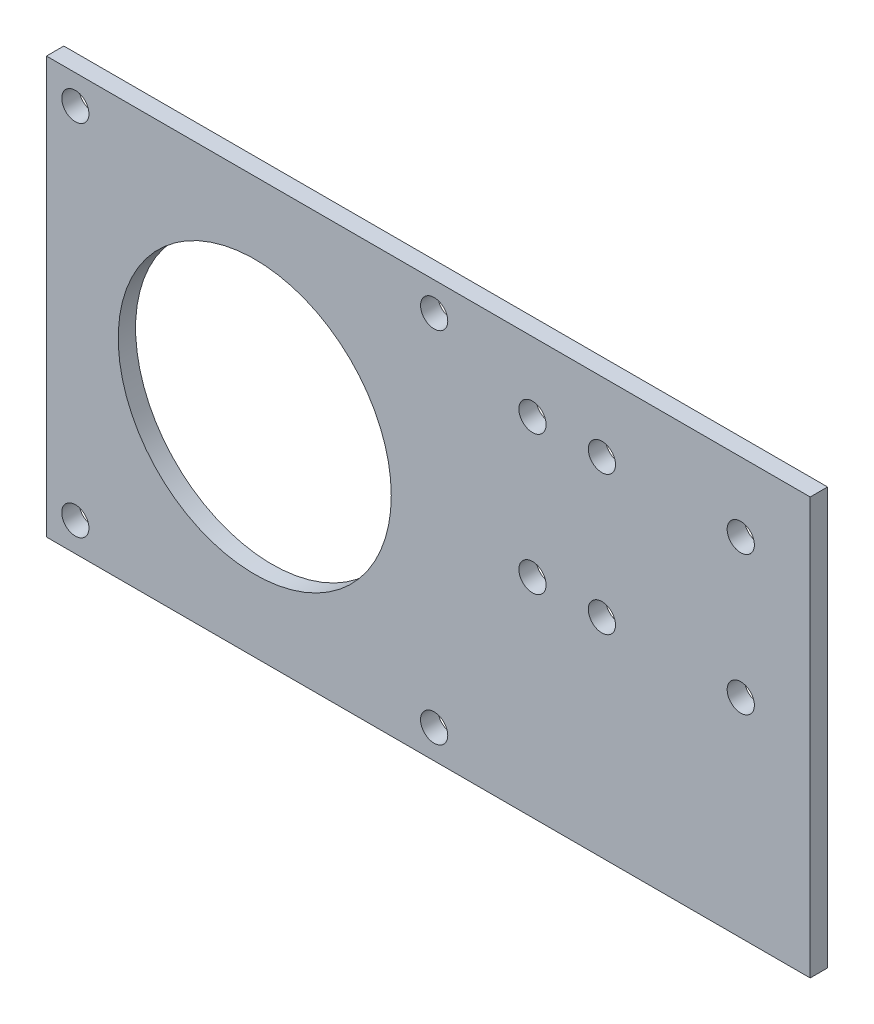
ISO-10303-21;
HEADER;
FILE_DESCRIPTION(('STEP AP214'),'2;1');
FILE_NAME('part.step','',(''),(''),'','','');
FILE_SCHEMA(('AUTOMOTIVE_DESIGN { 1 0 10303 214 1 1 1 1 }'));
ENDSEC;
DATA;
#1=APPLICATION_CONTEXT('core data for automotive mechanical design processes');
#2=APPLICATION_PROTOCOL_DEFINITION('international standard','automotive_design',2000,#1);
#3=PRODUCT_CONTEXT('',#1,'mechanical');
#4=PRODUCT('Part','Part','',(#3));
#5=PRODUCT_RELATED_PRODUCT_CATEGORY('part','',(#4));
#6=PRODUCT_DEFINITION_FORMATION('','',#4);
#7=PRODUCT_DEFINITION_CONTEXT('part definition',#1,'design');
#8=PRODUCT_DEFINITION('design','',#6,#7);
#9=PRODUCT_DEFINITION_SHAPE('','',#8);
#10=(LENGTH_UNIT() NAMED_UNIT(*) SI_UNIT(.MILLI.,.METRE.));
#11=(NAMED_UNIT(*) PLANE_ANGLE_UNIT() SI_UNIT($,.RADIAN.));
#12=(NAMED_UNIT(*) SI_UNIT($,.STERADIAN.) SOLID_ANGLE_UNIT());
#13=UNCERTAINTY_MEASURE_WITH_UNIT(LENGTH_MEASURE(1.E-05),#10,'distance_accuracy_value','');
#14=(GEOMETRIC_REPRESENTATION_CONTEXT(3) GLOBAL_UNCERTAINTY_ASSIGNED_CONTEXT((#13)) GLOBAL_UNIT_ASSIGNED_CONTEXT((#10,
#11,#12)) REPRESENTATION_CONTEXT('',''));
#15=CARTESIAN_POINT('',(0.,0.,0.));
#16=DIRECTION('',(0.,0.,1.));
#17=DIRECTION('',(1.,0.,0.));
#18=AXIS2_PLACEMENT_3D('',#15,#16,#17);
#19=CARTESIAN_POINT('',(0.,0.,3.175));
#20=DIRECTION('',(0.,0.,1.));
#21=DIRECTION('',(1.,0.,0.));
#22=AXIS2_PLACEMENT_3D('',#19,#20,#21);
#23=PLANE('',#22);
#24=CARTESIAN_POINT('',(-109.0168,184.29859,3.175));
#25=DIRECTION('',(0.,0.,1.));
#26=DIRECTION('',(1.,0.,0.));
#27=AXIS2_PLACEMENT_3D('',#24,#25,#26);
#28=CIRCLE('',#27,2.48920000000002);
#29=CARTESIAN_POINT('',(-106.5276,184.29859,3.175));
#30=VERTEX_POINT('',#29);
#31=EDGE_CURVE('E165',#30,#30,#28,.T.);
#32=ORIENTED_EDGE('',*,*,#31,.F.);
#33=EDGE_LOOP('',(#32));
#34=FACE_BOUND('',#33,.T.);
#35=CARTESIAN_POINT('',(12.7,151.48179,3.175));
#36=DIRECTION('',(0.,0.,1.));
#37=DIRECTION('',(1.,0.,0.));
#38=AXIS2_PLACEMENT_3D('',#35,#36,#37);
#39=CIRCLE('',#38,2.4892);
#40=CARTESIAN_POINT('',(15.1892,151.48179,3.175));
#41=VERTEX_POINT('',#40);
#42=EDGE_CURVE('E153',#41,#41,#39,.T.);
#43=ORIENTED_EDGE('',*,*,#42,.F.);
#44=EDGE_LOOP('',(#43));
#45=FACE_BOUND('',#44,.T.);
#46=CARTESIAN_POINT('',(-12.7,151.48179,3.175));
#47=DIRECTION('',(0.,0.,1.));
#48=DIRECTION('',(1.,0.,0.));
#49=AXIS2_PLACEMENT_3D('',#46,#47,#48);
#50=CIRCLE('',#49,2.4892);
#51=CARTESIAN_POINT('',(-10.2108,151.48179,3.175));
#52=VERTEX_POINT('',#51);
#53=EDGE_CURVE('E141',#52,#52,#50,.T.);
#54=ORIENTED_EDGE('',*,*,#53,.F.);
#55=EDGE_LOOP('',(#54));
#56=FACE_BOUND('',#55,.T.);
#57=CARTESIAN_POINT('',(-25.4,151.48179,3.175));
#58=DIRECTION('',(0.,0.,1.));
#59=DIRECTION('',(1.,0.,0.));
#60=AXIS2_PLACEMENT_3D('',#57,#58,#59);
#61=CIRCLE('',#60,2.48920000000001);
#62=CARTESIAN_POINT('',(-22.9108,151.48179,3.175));
#63=VERTEX_POINT('',#62);
#64=EDGE_CURVE('E129',#63,#63,#61,.T.);
#65=ORIENTED_EDGE('',*,*,#64,.F.);
#66=EDGE_LOOP('',(#65));
#67=FACE_BOUND('',#66,.T.);
#68=CARTESIAN_POINT('',(-76.2,151.48179,3.175));
#69=DIRECTION('',(0.,0.,1.));
#70=DIRECTION('',(1.,0.,0.));
#71=AXIS2_PLACEMENT_3D('',#68,#69,#70);
#72=CIRCLE('',#71,24.97201);
#73=CARTESIAN_POINT('',(-51.22799,151.48179,3.175));
#74=VERTEX_POINT('',#73);
#75=EDGE_CURVE('E117',#74,#74,#72,.T.);
#76=ORIENTED_EDGE('',*,*,#75,.F.);
#77=EDGE_LOOP('',(#76));
#78=FACE_BOUND('',#77,.T.);
#79=DIRECTION('',(0.,-1.,0.));
#80=VECTOR('',#79,1.);
#81=CARTESIAN_POINT('',(-114.3,189.58179,3.175));
#82=LINE('',#81,#80);
#83=CARTESIAN_POINT('',(-114.3,189.58179,3.175));
#84=VERTEX_POINT('',#83);
#85=CARTESIAN_POINT('',(-114.3,113.38179,3.175));
#86=VERTEX_POINT('',#85);
#87=EDGE_CURVE('E87',#84,#86,#82,.T.);
#88=ORIENTED_EDGE('',*,*,#87,.T.);
#89=DIRECTION('',(1.,0.,0.));
#90=VECTOR('',#89,1.);
#91=CARTESIAN_POINT('',(-114.3,113.38179,3.175));
#92=LINE('',#91,#90);
#93=CARTESIAN_POINT('',(25.4,113.38179,3.175));
#94=VERTEX_POINT('',#93);
#95=EDGE_CURVE('E82',#86,#94,#92,.T.);
#96=ORIENTED_EDGE('',*,*,#95,.T.);
#97=DIRECTION('',(0.,1.,0.));
#98=VECTOR('',#97,1.);
#99=CARTESIAN_POINT('',(25.4,189.58179,3.175));
#100=LINE('',#99,#98);
#101=CARTESIAN_POINT('',(25.4,189.58179,3.175));
#102=VERTEX_POINT('',#101);
#103=EDGE_CURVE('E85',#94,#102,#100,.T.);
#104=ORIENTED_EDGE('',*,*,#103,.T.);
#105=DIRECTION('',(-1.,0.,0.));
#106=VECTOR('',#105,1.);
#107=CARTESIAN_POINT('',(-114.3,189.58179,3.175));
#108=LINE('',#107,#106);
#109=EDGE_CURVE('E52',#102,#84,#108,.T.);
#110=ORIENTED_EDGE('',*,*,#109,.T.);
#111=EDGE_LOOP('',(#88,#96,#104,#110));
#112=FACE_BOUND('',#111,.T.);
#113=CARTESIAN_POINT('',(-109.0168,118.66499,3.175));
#114=DIRECTION('',(0.,0.,1.));
#115=DIRECTION('',(1.,0.,0.));
#116=AXIS2_PLACEMENT_3D('',#113,#114,#115);
#117=CIRCLE('',#116,2.48920000000002);
#118=CARTESIAN_POINT('',(-106.5276,118.66499,3.175));
#119=VERTEX_POINT('',#118);
#120=EDGE_CURVE('E102',#119,#119,#117,.T.);
#121=ORIENTED_EDGE('',*,*,#120,.F.);
#122=EDGE_LOOP('',(#121));
#123=FACE_BOUND('',#122,.T.);
#124=CARTESIAN_POINT('',(-43.3832,184.29859,3.175));
#125=DIRECTION('',(0.,0.,1.));
#126=DIRECTION('',(1.,0.,0.));
#127=AXIS2_PLACEMENT_3D('',#124,#125,#126);
#128=CIRCLE('',#127,2.48920000000001);
#129=CARTESIAN_POINT('',(-40.894,184.29859,3.175));
#130=VERTEX_POINT('',#129);
#131=EDGE_CURVE('E123',#130,#130,#128,.T.);
#132=ORIENTED_EDGE('',*,*,#131,.F.);
#133=EDGE_LOOP('',(#132));
#134=FACE_BOUND('',#133,.T.);
#135=CARTESIAN_POINT('',(-25.4,176.88179,3.175));
#136=DIRECTION('',(0.,0.,1.));
#137=DIRECTION('',(1.,0.,0.));
#138=AXIS2_PLACEMENT_3D('',#135,#136,#137);
#139=CIRCLE('',#138,2.48920000000001);
#140=CARTESIAN_POINT('',(-22.9108,176.88179,3.175));
#141=VERTEX_POINT('',#140);
#142=EDGE_CURVE('E135',#141,#141,#139,.T.);
#143=ORIENTED_EDGE('',*,*,#142,.F.);
#144=EDGE_LOOP('',(#143));
#145=FACE_BOUND('',#144,.T.);
#146=CARTESIAN_POINT('',(-12.7,176.88179,3.175));
#147=DIRECTION('',(0.,0.,1.));
#148=DIRECTION('',(1.,0.,0.));
#149=AXIS2_PLACEMENT_3D('',#146,#147,#148);
#150=CIRCLE('',#149,2.48920000000001);
#151=CARTESIAN_POINT('',(-10.2108,176.88179,3.175));
#152=VERTEX_POINT('',#151);
#153=EDGE_CURVE('E147',#152,#152,#150,.T.);
#154=ORIENTED_EDGE('',*,*,#153,.F.);
#155=EDGE_LOOP('',(#154));
#156=FACE_BOUND('',#155,.T.);
#157=CARTESIAN_POINT('',(12.7,176.88179,3.175));
#158=DIRECTION('',(0.,0.,1.));
#159=DIRECTION('',(1.,0.,0.));
#160=AXIS2_PLACEMENT_3D('',#157,#158,#159);
#161=CIRCLE('',#160,2.48920000000001);
#162=CARTESIAN_POINT('',(15.1892,176.88179,3.175));
#163=VERTEX_POINT('',#162);
#164=EDGE_CURVE('E159',#163,#163,#161,.T.);
#165=ORIENTED_EDGE('',*,*,#164,.F.);
#166=EDGE_LOOP('',(#165));
#167=FACE_BOUND('',#166,.T.);
#168=CARTESIAN_POINT('',(-43.3832,118.66499,3.175));
#169=DIRECTION('',(0.,0.,1.));
#170=DIRECTION('',(1.,0.,0.));
#171=AXIS2_PLACEMENT_3D('',#168,#169,#170);
#172=CIRCLE('',#171,2.4892);
#173=CARTESIAN_POINT('',(-40.894,118.66499,3.175));
#174=VERTEX_POINT('',#173);
#175=EDGE_CURVE('E171',#174,#174,#172,.T.);
#176=ORIENTED_EDGE('',*,*,#175,.F.);
#177=EDGE_LOOP('',(#176));
#178=FACE_BOUND('',#177,.T.);
#179=ADVANCED_FACE('F35',(#34,#45,#56,#67,#78,#112,#123,#134,#145,#156,#167,#178),#23,.T.);
#180=CARTESIAN_POINT('',(0.,0.,0.));
#181=DIRECTION('',(0.,0.,1.));
#182=DIRECTION('',(1.,0.,0.));
#183=AXIS2_PLACEMENT_3D('',#180,#181,#182);
#184=PLANE('',#183);
#185=DIRECTION('',(0.,-1.,0.));
#186=VECTOR('',#185,1.);
#187=CARTESIAN_POINT('',(-114.3,189.58179,0.));
#188=LINE('',#187,#186);
#189=CARTESIAN_POINT('',(-114.3,189.58179,0.));
#190=VERTEX_POINT('',#189);
#191=CARTESIAN_POINT('',(-114.3,113.38179,0.));
#192=VERTEX_POINT('',#191);
#193=EDGE_CURVE('E99',#190,#192,#188,.T.);
#194=ORIENTED_EDGE('',*,*,#193,.F.);
#195=DIRECTION('',(-1.,0.,0.));
#196=VECTOR('',#195,1.);
#197=CARTESIAN_POINT('',(-114.3,189.58179,0.));
#198=LINE('',#197,#196);
#199=CARTESIAN_POINT('',(25.4,189.58179,0.));
#200=VERTEX_POINT('',#199);
#201=EDGE_CURVE('E75',#200,#190,#198,.T.);
#202=ORIENTED_EDGE('',*,*,#201,.F.);
#203=DIRECTION('',(0.,1.,0.));
#204=VECTOR('',#203,1.);
#205=CARTESIAN_POINT('',(25.4,189.58179,0.));
#206=LINE('',#205,#204);
#207=CARTESIAN_POINT('',(25.4,113.38179,0.));
#208=VERTEX_POINT('',#207);
#209=EDGE_CURVE('E69',#208,#200,#206,.T.);
#210=ORIENTED_EDGE('',*,*,#209,.F.);
#211=DIRECTION('',(1.,0.,0.));
#212=VECTOR('',#211,1.);
#213=CARTESIAN_POINT('',(-114.3,113.38179,0.));
#214=LINE('',#213,#212);
#215=EDGE_CURVE('E91',#192,#208,#214,.T.);
#216=ORIENTED_EDGE('',*,*,#215,.F.);
#217=EDGE_LOOP('',(#194,#202,#210,#216));
#218=FACE_BOUND('',#217,.T.);
#219=CARTESIAN_POINT('',(-109.0168,118.66499,0.));
#220=DIRECTION('',(0.,0.,1.));
#221=DIRECTION('',(1.,0.,0.));
#222=AXIS2_PLACEMENT_3D('',#219,#220,#221);
#223=CIRCLE('',#222,2.48920000000002);
#224=CARTESIAN_POINT('',(-106.5276,118.66499,0.));
#225=VERTEX_POINT('',#224);
#226=EDGE_CURVE('E114',#225,#225,#223,.T.);
#227=ORIENTED_EDGE('',*,*,#226,.T.);
#228=EDGE_LOOP('',(#227));
#229=FACE_BOUND('',#228,.T.);
#230=CARTESIAN_POINT('',(-76.2,151.48179,0.));
#231=DIRECTION('',(0.,0.,1.));
#232=DIRECTION('',(1.,0.,0.));
#233=AXIS2_PLACEMENT_3D('',#230,#231,#232);
#234=CIRCLE('',#233,24.97201);
#235=CARTESIAN_POINT('',(-51.22799,151.48179,0.));
#236=VERTEX_POINT('',#235);
#237=EDGE_CURVE('E120',#236,#236,#234,.T.);
#238=ORIENTED_EDGE('',*,*,#237,.T.);
#239=EDGE_LOOP('',(#238));
#240=FACE_BOUND('',#239,.T.);
#241=CARTESIAN_POINT('',(-43.3832,184.29859,0.));
#242=DIRECTION('',(0.,0.,1.));
#243=DIRECTION('',(1.,0.,0.));
#244=AXIS2_PLACEMENT_3D('',#241,#242,#243);
#245=CIRCLE('',#244,2.48920000000001);
#246=CARTESIAN_POINT('',(-40.894,184.29859,0.));
#247=VERTEX_POINT('',#246);
#248=EDGE_CURVE('E126',#247,#247,#245,.T.);
#249=ORIENTED_EDGE('',*,*,#248,.T.);
#250=EDGE_LOOP('',(#249));
#251=FACE_BOUND('',#250,.T.);
#252=CARTESIAN_POINT('',(-25.4,151.48179,0.));
#253=DIRECTION('',(0.,0.,1.));
#254=DIRECTION('',(1.,0.,0.));
#255=AXIS2_PLACEMENT_3D('',#252,#253,#254);
#256=CIRCLE('',#255,2.48920000000001);
#257=CARTESIAN_POINT('',(-22.9108,151.48179,0.));
#258=VERTEX_POINT('',#257);
#259=EDGE_CURVE('E132',#258,#258,#256,.T.);
#260=ORIENTED_EDGE('',*,*,#259,.T.);
#261=EDGE_LOOP('',(#260));
#262=FACE_BOUND('',#261,.T.);
#263=CARTESIAN_POINT('',(-25.4,176.88179,0.));
#264=DIRECTION('',(0.,0.,1.));
#265=DIRECTION('',(1.,0.,0.));
#266=AXIS2_PLACEMENT_3D('',#263,#264,#265);
#267=CIRCLE('',#266,2.48920000000001);
#268=CARTESIAN_POINT('',(-22.9108,176.88179,0.));
#269=VERTEX_POINT('',#268);
#270=EDGE_CURVE('E138',#269,#269,#267,.T.);
#271=ORIENTED_EDGE('',*,*,#270,.T.);
#272=EDGE_LOOP('',(#271));
#273=FACE_BOUND('',#272,.T.);
#274=CARTESIAN_POINT('',(-12.7,151.48179,0.));
#275=DIRECTION('',(0.,0.,1.));
#276=DIRECTION('',(1.,0.,0.));
#277=AXIS2_PLACEMENT_3D('',#274,#275,#276);
#278=CIRCLE('',#277,2.4892);
#279=CARTESIAN_POINT('',(-10.2108,151.48179,0.));
#280=VERTEX_POINT('',#279);
#281=EDGE_CURVE('E144',#280,#280,#278,.T.);
#282=ORIENTED_EDGE('',*,*,#281,.T.);
#283=EDGE_LOOP('',(#282));
#284=FACE_BOUND('',#283,.T.);
#285=CARTESIAN_POINT('',(-12.7,176.88179,0.));
#286=DIRECTION('',(0.,0.,1.));
#287=DIRECTION('',(1.,0.,0.));
#288=AXIS2_PLACEMENT_3D('',#285,#286,#287);
#289=CIRCLE('',#288,2.48920000000001);
#290=CARTESIAN_POINT('',(-10.2108,176.88179,0.));
#291=VERTEX_POINT('',#290);
#292=EDGE_CURVE('E150',#291,#291,#289,.T.);
#293=ORIENTED_EDGE('',*,*,#292,.T.);
#294=EDGE_LOOP('',(#293));
#295=FACE_BOUND('',#294,.T.);
#296=CARTESIAN_POINT('',(12.7,151.48179,0.));
#297=DIRECTION('',(0.,0.,1.));
#298=DIRECTION('',(1.,0.,0.));
#299=AXIS2_PLACEMENT_3D('',#296,#297,#298);
#300=CIRCLE('',#299,2.4892);
#301=CARTESIAN_POINT('',(15.1892,151.48179,0.));
#302=VERTEX_POINT('',#301);
#303=EDGE_CURVE('E156',#302,#302,#300,.T.);
#304=ORIENTED_EDGE('',*,*,#303,.T.);
#305=EDGE_LOOP('',(#304));
#306=FACE_BOUND('',#305,.T.);
#307=CARTESIAN_POINT('',(12.7,176.88179,0.));
#308=DIRECTION('',(0.,0.,1.));
#309=DIRECTION('',(1.,0.,0.));
#310=AXIS2_PLACEMENT_3D('',#307,#308,#309);
#311=CIRCLE('',#310,2.48920000000001);
#312=CARTESIAN_POINT('',(15.1892,176.88179,0.));
#313=VERTEX_POINT('',#312);
#314=EDGE_CURVE('E162',#313,#313,#311,.T.);
#315=ORIENTED_EDGE('',*,*,#314,.T.);
#316=EDGE_LOOP('',(#315));
#317=FACE_BOUND('',#316,.T.);
#318=CARTESIAN_POINT('',(-109.0168,184.29859,0.));
#319=DIRECTION('',(0.,0.,1.));
#320=DIRECTION('',(1.,0.,0.));
#321=AXIS2_PLACEMENT_3D('',#318,#319,#320);
#322=CIRCLE('',#321,2.48920000000002);
#323=CARTESIAN_POINT('',(-106.5276,184.29859,0.));
#324=VERTEX_POINT('',#323);
#325=EDGE_CURVE('E168',#324,#324,#322,.T.);
#326=ORIENTED_EDGE('',*,*,#325,.T.);
#327=EDGE_LOOP('',(#326));
#328=FACE_BOUND('',#327,.T.);
#329=CARTESIAN_POINT('',(-43.3832,118.66499,0.));
#330=DIRECTION('',(0.,0.,1.));
#331=DIRECTION('',(1.,0.,0.));
#332=AXIS2_PLACEMENT_3D('',#329,#330,#331);
#333=CIRCLE('',#332,2.4892);
#334=CARTESIAN_POINT('',(-40.894,118.66499,0.));
#335=VERTEX_POINT('',#334);
#336=EDGE_CURVE('E174',#335,#335,#333,.T.);
#337=ORIENTED_EDGE('',*,*,#336,.T.);
#338=EDGE_LOOP('',(#337));
#339=FACE_BOUND('',#338,.T.);
#340=ADVANCED_FACE('F110',(#218,#229,#240,#251,#262,#273,#284,#295,#306,#317,#328,#339),#184,.F.);
#341=CARTESIAN_POINT('',(-114.3,189.58179,3.175));
#342=DIRECTION('',(1.,0.,0.));
#343=DIRECTION('',(0.,1.,0.));
#344=AXIS2_PLACEMENT_3D('',#341,#342,#343);
#345=PLANE('',#344);
#346=ORIENTED_EDGE('',*,*,#193,.T.);
#347=DIRECTION('',(0.,0.,-1.));
#348=VECTOR('',#347,1.);
#349=CARTESIAN_POINT('',(-114.3,113.38179,3.175));
#350=LINE('',#349,#348);
#351=EDGE_CURVE('E11',#86,#192,#350,.T.);
#352=ORIENTED_EDGE('',*,*,#351,.F.);
#353=ORIENTED_EDGE('',*,*,#87,.F.);
#354=DIRECTION('',(0.,0.,-1.));
#355=VECTOR('',#354,1.);
#356=CARTESIAN_POINT('',(-114.3,189.58179,3.175));
#357=LINE('',#356,#355);
#358=EDGE_CURVE('E95',#84,#190,#357,.T.);
#359=ORIENTED_EDGE('',*,*,#358,.T.);
#360=EDGE_LOOP('',(#346,#352,#353,#359));
#361=FACE_BOUND('',#360,.T.);
#362=ADVANCED_FACE('F37',(#361),#345,.F.);
#363=CARTESIAN_POINT('',(-114.3,113.38179,3.175));
#364=DIRECTION('',(0.,1.,0.));
#365=DIRECTION('',(0.,0.,1.));
#366=AXIS2_PLACEMENT_3D('',#363,#364,#365);
#367=PLANE('',#366);
#368=ORIENTED_EDGE('',*,*,#215,.T.);
#369=DIRECTION('',(0.,0.,-1.));
#370=VECTOR('',#369,1.);
#371=CARTESIAN_POINT('',(25.4,113.38179,3.175));
#372=LINE('',#371,#370);
#373=EDGE_CURVE('E44',#94,#208,#372,.T.);
#374=ORIENTED_EDGE('',*,*,#373,.F.);
#375=ORIENTED_EDGE('',*,*,#95,.F.);
#376=ORIENTED_EDGE('',*,*,#351,.T.);
#377=EDGE_LOOP('',(#368,#374,#375,#376));
#378=FACE_BOUND('',#377,.T.);
#379=ADVANCED_FACE('F90',(#378),#367,.F.);
#380=CARTESIAN_POINT('',(25.4,189.58179,3.175));
#381=DIRECTION('',(-1.,0.,0.));
#382=DIRECTION('',(0.,0.,1.));
#383=AXIS2_PLACEMENT_3D('',#380,#381,#382);
#384=PLANE('',#383);
#385=ORIENTED_EDGE('',*,*,#209,.T.);
#386=DIRECTION('',(0.,0.,-1.));
#387=VECTOR('',#386,1.);
#388=CARTESIAN_POINT('',(25.4,189.58179,3.175));
#389=LINE('',#388,#387);
#390=EDGE_CURVE('E92',#102,#200,#389,.T.);
#391=ORIENTED_EDGE('',*,*,#390,.F.);
#392=ORIENTED_EDGE('',*,*,#103,.F.);
#393=ORIENTED_EDGE('',*,*,#373,.T.);
#394=EDGE_LOOP('',(#385,#391,#392,#393));
#395=FACE_BOUND('',#394,.T.);
#396=ADVANCED_FACE('F93',(#395),#384,.F.);
#397=CARTESIAN_POINT('',(-114.3,189.58179,3.175));
#398=DIRECTION('',(0.,-1.,0.));
#399=DIRECTION('',(0.,0.,-1.));
#400=AXIS2_PLACEMENT_3D('',#397,#398,#399);
#401=PLANE('',#400);
#402=ORIENTED_EDGE('',*,*,#201,.T.);
#403=ORIENTED_EDGE('',*,*,#358,.F.);
#404=ORIENTED_EDGE('',*,*,#109,.F.);
#405=ORIENTED_EDGE('',*,*,#390,.T.);
#406=EDGE_LOOP('',(#402,#403,#404,#405));
#407=FACE_BOUND('',#406,.T.);
#408=ADVANCED_FACE('F107',(#407),#401,.F.);
#409=CARTESIAN_POINT('',(-109.0168,118.66499,3.175));
#410=DIRECTION('',(0.,0.,-1.));
#411=DIRECTION('',(-1.,0.,0.));
#412=AXIS2_PLACEMENT_3D('',#409,#410,#411);
#413=CYLINDRICAL_SURFACE('',#412,2.48920000000002);
#414=ORIENTED_EDGE('',*,*,#120,.T.);
#415=EDGE_LOOP('',(#414));
#416=FACE_BOUND('',#415,.T.);
#417=ORIENTED_EDGE('',*,*,#226,.F.);
#418=EDGE_LOOP('',(#417));
#419=FACE_BOUND('',#418,.T.);
#420=ADVANCED_FACE('F193',(#416,#419),#413,.F.);
#421=CARTESIAN_POINT('',(-76.2,151.48179,3.175));
#422=DIRECTION('',(0.,0.,-1.));
#423=DIRECTION('',(-1.,0.,0.));
#424=AXIS2_PLACEMENT_3D('',#421,#422,#423);
#425=CYLINDRICAL_SURFACE('',#424,24.97201);
#426=ORIENTED_EDGE('',*,*,#75,.T.);
#427=EDGE_LOOP('',(#426));
#428=FACE_BOUND('',#427,.T.);
#429=ORIENTED_EDGE('',*,*,#237,.F.);
#430=EDGE_LOOP('',(#429));
#431=FACE_BOUND('',#430,.T.);
#432=ADVANCED_FACE('F239',(#428,#431),#425,.F.);
#433=CARTESIAN_POINT('',(-43.3832,184.29859,3.175));
#434=DIRECTION('',(0.,0.,-1.));
#435=DIRECTION('',(-1.,0.,0.));
#436=AXIS2_PLACEMENT_3D('',#433,#434,#435);
#437=CYLINDRICAL_SURFACE('',#436,2.48920000000001);
#438=ORIENTED_EDGE('',*,*,#131,.T.);
#439=EDGE_LOOP('',(#438));
#440=FACE_BOUND('',#439,.T.);
#441=ORIENTED_EDGE('',*,*,#248,.F.);
#442=EDGE_LOOP('',(#441));
#443=FACE_BOUND('',#442,.T.);
#444=ADVANCED_FACE('F247',(#440,#443),#437,.F.);
#445=CARTESIAN_POINT('',(-25.4,151.48179,3.175));
#446=DIRECTION('',(0.,0.,-1.));
#447=DIRECTION('',(-1.,0.,0.));
#448=AXIS2_PLACEMENT_3D('',#445,#446,#447);
#449=CYLINDRICAL_SURFACE('',#448,2.48920000000001);
#450=ORIENTED_EDGE('',*,*,#64,.T.);
#451=EDGE_LOOP('',(#450));
#452=FACE_BOUND('',#451,.T.);
#453=ORIENTED_EDGE('',*,*,#259,.F.);
#454=EDGE_LOOP('',(#453));
#455=FACE_BOUND('',#454,.T.);
#456=ADVANCED_FACE('F255',(#452,#455),#449,.F.);
#457=CARTESIAN_POINT('',(-25.4,176.88179,3.175));
#458=DIRECTION('',(0.,0.,-1.));
#459=DIRECTION('',(-1.,0.,0.));
#460=AXIS2_PLACEMENT_3D('',#457,#458,#459);
#461=CYLINDRICAL_SURFACE('',#460,2.48920000000001);
#462=ORIENTED_EDGE('',*,*,#142,.T.);
#463=EDGE_LOOP('',(#462));
#464=FACE_BOUND('',#463,.T.);
#465=ORIENTED_EDGE('',*,*,#270,.F.);
#466=EDGE_LOOP('',(#465));
#467=FACE_BOUND('',#466,.T.);
#468=ADVANCED_FACE('F264',(#464,#467),#461,.F.);
#469=CARTESIAN_POINT('',(-12.7,151.48179,3.175));
#470=DIRECTION('',(0.,0.,-1.));
#471=DIRECTION('',(-1.,0.,0.));
#472=AXIS2_PLACEMENT_3D('',#469,#470,#471);
#473=CYLINDRICAL_SURFACE('',#472,2.4892);
#474=ORIENTED_EDGE('',*,*,#53,.T.);
#475=EDGE_LOOP('',(#474));
#476=FACE_BOUND('',#475,.T.);
#477=ORIENTED_EDGE('',*,*,#281,.F.);
#478=EDGE_LOOP('',(#477));
#479=FACE_BOUND('',#478,.T.);
#480=ADVANCED_FACE('F273',(#476,#479),#473,.F.);
#481=CARTESIAN_POINT('',(-12.7,176.88179,3.175));
#482=DIRECTION('',(0.,0.,-1.));
#483=DIRECTION('',(-1.,0.,0.));
#484=AXIS2_PLACEMENT_3D('',#481,#482,#483);
#485=CYLINDRICAL_SURFACE('',#484,2.48920000000001);
#486=ORIENTED_EDGE('',*,*,#153,.T.);
#487=EDGE_LOOP('',(#486));
#488=FACE_BOUND('',#487,.T.);
#489=ORIENTED_EDGE('',*,*,#292,.F.);
#490=EDGE_LOOP('',(#489));
#491=FACE_BOUND('',#490,.T.);
#492=ADVANCED_FACE('F282',(#488,#491),#485,.F.);
#493=CARTESIAN_POINT('',(12.7,151.48179,3.175));
#494=DIRECTION('',(0.,0.,-1.));
#495=DIRECTION('',(-1.,0.,0.));
#496=AXIS2_PLACEMENT_3D('',#493,#494,#495);
#497=CYLINDRICAL_SURFACE('',#496,2.4892);
#498=ORIENTED_EDGE('',*,*,#42,.T.);
#499=EDGE_LOOP('',(#498));
#500=FACE_BOUND('',#499,.T.);
#501=ORIENTED_EDGE('',*,*,#303,.F.);
#502=EDGE_LOOP('',(#501));
#503=FACE_BOUND('',#502,.T.);
#504=ADVANCED_FACE('F291',(#500,#503),#497,.F.);
#505=CARTESIAN_POINT('',(12.7,176.88179,3.175));
#506=DIRECTION('',(0.,0.,-1.));
#507=DIRECTION('',(-1.,0.,0.));
#508=AXIS2_PLACEMENT_3D('',#505,#506,#507);
#509=CYLINDRICAL_SURFACE('',#508,2.48920000000001);
#510=ORIENTED_EDGE('',*,*,#164,.T.);
#511=EDGE_LOOP('',(#510));
#512=FACE_BOUND('',#511,.T.);
#513=ORIENTED_EDGE('',*,*,#314,.F.);
#514=EDGE_LOOP('',(#513));
#515=FACE_BOUND('',#514,.T.);
#516=ADVANCED_FACE('F300',(#512,#515),#509,.F.);
#517=CARTESIAN_POINT('',(-109.0168,184.29859,3.175));
#518=DIRECTION('',(0.,0.,-1.));
#519=DIRECTION('',(-1.,0.,0.));
#520=AXIS2_PLACEMENT_3D('',#517,#518,#519);
#521=CYLINDRICAL_SURFACE('',#520,2.48920000000002);
#522=ORIENTED_EDGE('',*,*,#31,.T.);
#523=EDGE_LOOP('',(#522));
#524=FACE_BOUND('',#523,.T.);
#525=ORIENTED_EDGE('',*,*,#325,.F.);
#526=EDGE_LOOP('',(#525));
#527=FACE_BOUND('',#526,.T.);
#528=ADVANCED_FACE('F309',(#524,#527),#521,.F.);
#529=CARTESIAN_POINT('',(-43.3832,118.66499,3.175));
#530=DIRECTION('',(0.,0.,-1.));
#531=DIRECTION('',(-1.,0.,0.));
#532=AXIS2_PLACEMENT_3D('',#529,#530,#531);
#533=CYLINDRICAL_SURFACE('',#532,2.4892);
#534=ORIENTED_EDGE('',*,*,#175,.T.);
#535=EDGE_LOOP('',(#534));
#536=FACE_BOUND('',#535,.T.);
#537=ORIENTED_EDGE('',*,*,#336,.F.);
#538=EDGE_LOOP('',(#537));
#539=FACE_BOUND('',#538,.T.);
#540=ADVANCED_FACE('F180',(#536,#539),#533,.F.);
#541=CLOSED_SHELL('',(#179,#340,#362,#379,#396,#408,#420,#432,#444,#456,#468,#480,#492,#504,
#516,#528,#540));
#542=MANIFOLD_SOLID_BREP('B2',#541);
#543=ADVANCED_BREP_SHAPE_REPRESENTATION('',(#18,#542),#14);
#544=SHAPE_DEFINITION_REPRESENTATION(#9,#543);
ENDSEC;
END-ISO-10303-21;
